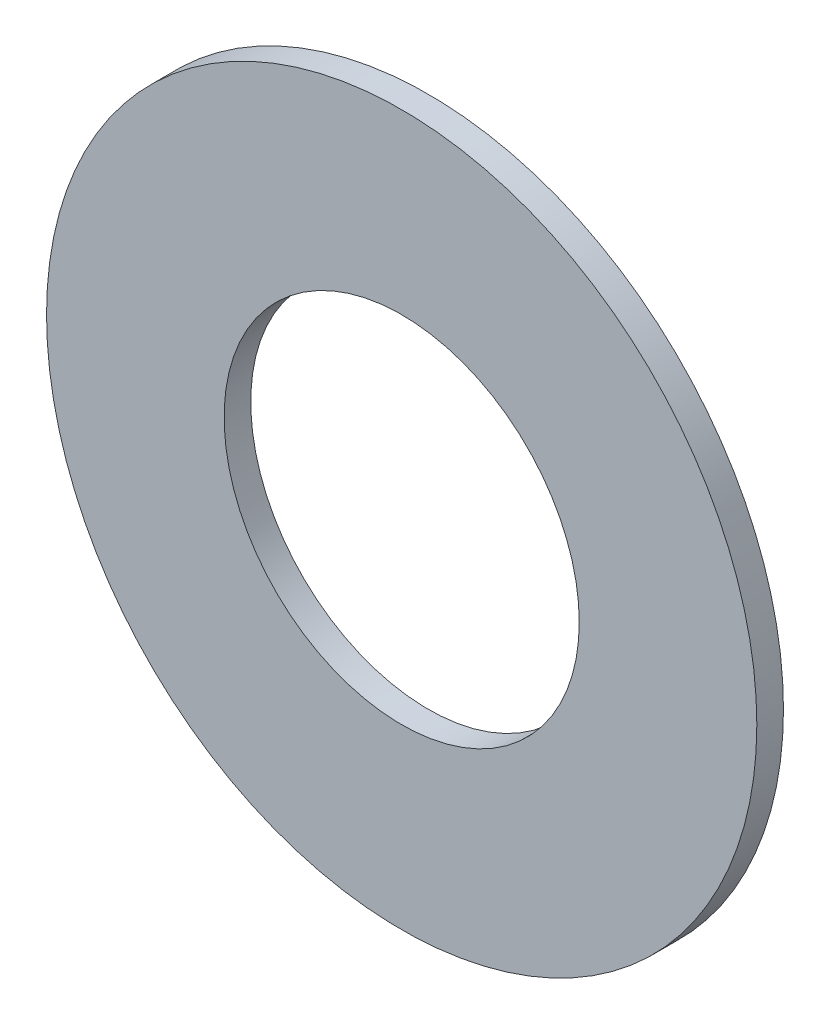
ISO-10303-21;
HEADER;
FILE_DESCRIPTION(('STEP AP214'),'2;1');
FILE_NAME('part.step','',(''),(''),'','','');
FILE_SCHEMA(('AUTOMOTIVE_DESIGN { 1 0 10303 214 1 1 1 1 }'));
ENDSEC;
DATA;
#1=APPLICATION_CONTEXT('core data for automotive mechanical design processes');
#2=APPLICATION_PROTOCOL_DEFINITION('international standard','automotive_design',2000,#1);
#3=PRODUCT_CONTEXT('',#1,'mechanical');
#4=PRODUCT('Part','Part','',(#3));
#5=PRODUCT_RELATED_PRODUCT_CATEGORY('part','',(#4));
#6=PRODUCT_DEFINITION_FORMATION('','',#4);
#7=PRODUCT_DEFINITION_CONTEXT('part definition',#1,'design');
#8=PRODUCT_DEFINITION('design','',#6,#7);
#9=PRODUCT_DEFINITION_SHAPE('','',#8);
#10=(LENGTH_UNIT() NAMED_UNIT(*) SI_UNIT(.MILLI.,.METRE.));
#11=(NAMED_UNIT(*) PLANE_ANGLE_UNIT() SI_UNIT($,.RADIAN.));
#12=(NAMED_UNIT(*) SI_UNIT($,.STERADIAN.) SOLID_ANGLE_UNIT());
#13=UNCERTAINTY_MEASURE_WITH_UNIT(LENGTH_MEASURE(1.E-05),#10,'distance_accuracy_value','');
#14=(GEOMETRIC_REPRESENTATION_CONTEXT(3) GLOBAL_UNCERTAINTY_ASSIGNED_CONTEXT((#13)) GLOBAL_UNIT_ASSIGNED_CONTEXT((#10,
#11,#12)) REPRESENTATION_CONTEXT('',''));
#15=CARTESIAN_POINT('',(0.,0.,0.));
#16=DIRECTION('',(0.,0.,1.));
#17=DIRECTION('',(1.,0.,0.));
#18=AXIS2_PLACEMENT_3D('',#15,#16,#17);
#19=CARTESIAN_POINT('',(0.,0.,1.2));
#20=DIRECTION('',(0.,0.,1.));
#21=DIRECTION('',(1.,0.,0.));
#22=AXIS2_PLACEMENT_3D('',#19,#20,#21);
#23=PLANE('',#22);
#24=CARTESIAN_POINT('',(0.,0.,1.2));
#25=DIRECTION('',(0.,0.,1.));
#26=DIRECTION('',(1.,0.,0.));
#27=AXIS2_PLACEMENT_3D('',#24,#25,#26);
#28=CIRCLE('',#27,16.);
#29=CARTESIAN_POINT('',(16.,0.,1.2));
#30=VERTEX_POINT('',#29);
#31=EDGE_CURVE('E10',#30,#30,#28,.T.);
#32=ORIENTED_EDGE('',*,*,#31,.T.);
#33=EDGE_LOOP('',(#32));
#34=FACE_BOUND('',#33,.T.);
#35=CARTESIAN_POINT('',(0.,0.,1.2));
#36=DIRECTION('',(0.,0.,1.));
#37=DIRECTION('',(1.,0.,0.));
#38=AXIS2_PLACEMENT_3D('',#35,#36,#37);
#39=CIRCLE('',#38,8.);
#40=CARTESIAN_POINT('',(8.,0.,1.2));
#41=VERTEX_POINT('',#40);
#42=EDGE_CURVE('E56',#41,#41,#39,.T.);
#43=ORIENTED_EDGE('',*,*,#42,.F.);
#44=EDGE_LOOP('',(#43));
#45=FACE_BOUND('',#44,.T.);
#46=ADVANCED_FACE('F43',(#34,#45),#23,.T.);
#47=CARTESIAN_POINT('',(0.,0.,0.));
#48=DIRECTION('',(0.,0.,1.));
#49=DIRECTION('',(1.,0.,0.));
#50=AXIS2_PLACEMENT_3D('',#47,#48,#49);
#51=PLANE('',#50);
#52=CARTESIAN_POINT('',(0.,0.,0.));
#53=DIRECTION('',(0.,0.,1.));
#54=DIRECTION('',(1.,0.,0.));
#55=AXIS2_PLACEMENT_3D('',#52,#53,#54);
#56=CIRCLE('',#55,16.);
#57=CARTESIAN_POINT('',(16.,0.,0.));
#58=VERTEX_POINT('',#57);
#59=EDGE_CURVE('E47',#58,#58,#56,.T.);
#60=ORIENTED_EDGE('',*,*,#59,.F.);
#61=EDGE_LOOP('',(#60));
#62=FACE_BOUND('',#61,.T.);
#63=CARTESIAN_POINT('',(0.,0.,0.));
#64=DIRECTION('',(0.,0.,1.));
#65=DIRECTION('',(1.,0.,0.));
#66=AXIS2_PLACEMENT_3D('',#63,#64,#65);
#67=CIRCLE('',#66,8.);
#68=CARTESIAN_POINT('',(8.,0.,0.));
#69=VERTEX_POINT('',#68);
#70=EDGE_CURVE('E58',#69,#69,#67,.T.);
#71=ORIENTED_EDGE('',*,*,#70,.T.);
#72=EDGE_LOOP('',(#71));
#73=FACE_BOUND('',#72,.T.);
#74=ADVANCED_FACE('F70',(#62,#73),#51,.F.);
#75=CARTESIAN_POINT('',(0.,0.,1.2));
#76=DIRECTION('',(0.,0.,-1.));
#77=DIRECTION('',(-1.,0.,0.));
#78=AXIS2_PLACEMENT_3D('',#75,#76,#77);
#79=CYLINDRICAL_SURFACE('',#78,16.);
#80=ORIENTED_EDGE('',*,*,#31,.F.);
#81=EDGE_LOOP('',(#80));
#82=FACE_BOUND('',#81,.T.);
#83=ORIENTED_EDGE('',*,*,#59,.T.);
#84=EDGE_LOOP('',(#83));
#85=FACE_BOUND('',#84,.T.);
#86=ADVANCED_FACE('F45',(#82,#85),#79,.T.);
#87=CARTESIAN_POINT('',(0.,0.,1.2));
#88=DIRECTION('',(0.,0.,-1.));
#89=DIRECTION('',(-1.,0.,0.));
#90=AXIS2_PLACEMENT_3D('',#87,#88,#89);
#91=CYLINDRICAL_SURFACE('',#90,8.);
#92=ORIENTED_EDGE('',*,*,#42,.T.);
#93=EDGE_LOOP('',(#92));
#94=FACE_BOUND('',#93,.T.);
#95=ORIENTED_EDGE('',*,*,#70,.F.);
#96=EDGE_LOOP('',(#95));
#97=FACE_BOUND('',#96,.T.);
#98=ADVANCED_FACE('F66',(#94,#97),#91,.F.);
#99=CLOSED_SHELL('',(#46,#74,#86,#98));
#100=MANIFOLD_SOLID_BREP('B2',#99);
#101=ADVANCED_BREP_SHAPE_REPRESENTATION('',(#18,#100),#14);
#102=SHAPE_DEFINITION_REPRESENTATION(#9,#101);
ENDSEC;
END-ISO-10303-21;
